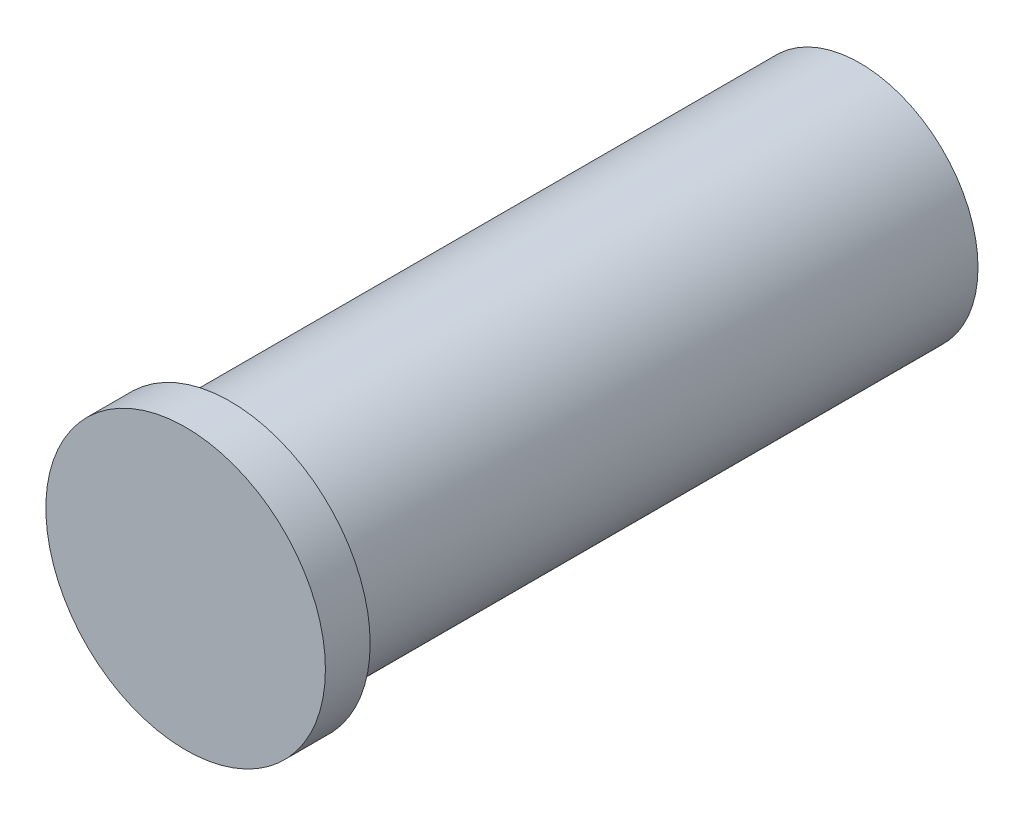
ISO-10303-21;
HEADER;
FILE_DESCRIPTION(('STEP AP214'),'2;1');
FILE_NAME('part.step','',(''),(''),'','','');
FILE_SCHEMA(('AUTOMOTIVE_DESIGN { 1 0 10303 214 1 1 1 1 }'));
ENDSEC;
DATA;
#1=APPLICATION_CONTEXT('core data for automotive mechanical design processes');
#2=APPLICATION_PROTOCOL_DEFINITION('international standard','automotive_design',2000,#1);
#3=PRODUCT_CONTEXT('',#1,'mechanical');
#4=PRODUCT('Part','Part','',(#3));
#5=PRODUCT_RELATED_PRODUCT_CATEGORY('part','',(#4));
#6=PRODUCT_DEFINITION_FORMATION('','',#4);
#7=PRODUCT_DEFINITION_CONTEXT('part definition',#1,'design');
#8=PRODUCT_DEFINITION('design','',#6,#7);
#9=PRODUCT_DEFINITION_SHAPE('','',#8);
#10=(LENGTH_UNIT() NAMED_UNIT(*) SI_UNIT(.MILLI.,.METRE.));
#11=(NAMED_UNIT(*) PLANE_ANGLE_UNIT() SI_UNIT($,.RADIAN.));
#12=(NAMED_UNIT(*) SI_UNIT($,.STERADIAN.) SOLID_ANGLE_UNIT());
#13=UNCERTAINTY_MEASURE_WITH_UNIT(LENGTH_MEASURE(1.E-05),#10,'distance_accuracy_value','');
#14=(GEOMETRIC_REPRESENTATION_CONTEXT(3) GLOBAL_UNCERTAINTY_ASSIGNED_CONTEXT((#13)) GLOBAL_UNIT_ASSIGNED_CONTEXT((#10,
#11,#12)) REPRESENTATION_CONTEXT('',''));
#15=CARTESIAN_POINT('',(0.,0.,0.));
#16=DIRECTION('',(0.,0.,1.));
#17=DIRECTION('',(1.,0.,0.));
#18=AXIS2_PLACEMENT_3D('',#15,#16,#17);
#19=CARTESIAN_POINT('',(0.,0.,0.));
#20=DIRECTION('',(0.,0.,1.));
#21=DIRECTION('',(1.,0.,0.));
#22=AXIS2_PLACEMENT_3D('',#19,#20,#21);
#23=PLANE('',#22);
#24=CARTESIAN_POINT('',(0.,0.,0.));
#25=DIRECTION('',(0.,0.,1.));
#26=DIRECTION('',(1.,0.,0.));
#27=AXIS2_PLACEMENT_3D('',#24,#25,#26);
#28=CIRCLE('',#27,21.11111111375);
#29=CARTESIAN_POINT('',(21.11111111375,0.,0.));
#30=VERTEX_POINT('',#29);
#31=EDGE_CURVE('E38',#30,#30,#28,.T.);
#32=ORIENTED_EDGE('',*,*,#31,.F.);
#33=EDGE_LOOP('',(#32));
#34=FACE_BOUND('',#33,.T.);
#35=CARTESIAN_POINT('',(0.,0.,0.));
#36=DIRECTION('',(0.,0.,1.));
#37=DIRECTION('',(1.,0.,0.));
#38=AXIS2_PLACEMENT_3D('',#35,#36,#37);
#39=CIRCLE('',#38,19.000000002375);
#40=CARTESIAN_POINT('',(19.000000002375,0.,0.));
#41=VERTEX_POINT('',#40);
#42=EDGE_CURVE('E45',#41,#41,#39,.T.);
#43=ORIENTED_EDGE('',*,*,#42,.T.);
#44=EDGE_LOOP('',(#43));
#45=FACE_BOUND('',#44,.T.);
#46=ADVANCED_FACE('F34',(#34,#45),#23,.F.);
#47=CARTESIAN_POINT('',(0.,0.,112.592592606667));
#48=DIRECTION('',(0.,0.,-1.));
#49=DIRECTION('',(-1.,0.,0.));
#50=AXIS2_PLACEMENT_3D('',#47,#48,#49);
#51=CYLINDRICAL_SURFACE('',#50,21.11111111375);
#52=CARTESIAN_POINT('',(0.,0.,112.592592606667));
#53=DIRECTION('',(0.,0.,1.));
#54=DIRECTION('',(1.,0.,0.));
#55=AXIS2_PLACEMENT_3D('',#52,#53,#54);
#56=CIRCLE('',#55,21.11111111375);
#57=CARTESIAN_POINT('',(21.11111111375,0.,112.592592606667));
#58=VERTEX_POINT('',#57);
#59=EDGE_CURVE('E10',#58,#58,#56,.T.);
#60=ORIENTED_EDGE('',*,*,#59,.F.);
#61=EDGE_LOOP('',(#60));
#62=FACE_BOUND('',#61,.T.);
#63=ORIENTED_EDGE('',*,*,#31,.T.);
#64=EDGE_LOOP('',(#63));
#65=FACE_BOUND('',#64,.T.);
#66=ADVANCED_FACE('F36',(#62,#65),#51,.T.);
#67=CARTESIAN_POINT('',(0.,0.,112.592592606667));
#68=DIRECTION('',(0.,0.,-1.));
#69=DIRECTION('',(-1.,0.,0.));
#70=AXIS2_PLACEMENT_3D('',#67,#68,#69);
#71=CYLINDRICAL_SURFACE('',#70,19.000000002375);
#72=CARTESIAN_POINT('',(0.,0.,112.592592606667));
#73=DIRECTION('',(0.,0.,1.));
#74=DIRECTION('',(1.,0.,0.));
#75=AXIS2_PLACEMENT_3D('',#72,#73,#74);
#76=CIRCLE('',#75,19.000000002375);
#77=CARTESIAN_POINT('',(19.000000002375,0.,112.592592606667));
#78=VERTEX_POINT('',#77);
#79=EDGE_CURVE('E49',#78,#78,#76,.T.);
#80=ORIENTED_EDGE('',*,*,#79,.T.);
#81=EDGE_LOOP('',(#80));
#82=FACE_BOUND('',#81,.T.);
#83=ORIENTED_EDGE('',*,*,#42,.F.);
#84=EDGE_LOOP('',(#83));
#85=FACE_BOUND('',#84,.T.);
#86=ADVANCED_FACE('F76',(#82,#85),#71,.F.);
#87=CARTESIAN_POINT('',(0.,0.,112.592592606667));
#88=DIRECTION('',(0.,0.,1.));
#89=DIRECTION('',(1.,0.,0.));
#90=AXIS2_PLACEMENT_3D('',#87,#88,#89);
#91=PLANE('',#90);
#92=ORIENTED_EDGE('',*,*,#79,.F.);
#93=EDGE_LOOP('',(#92));
#94=FACE_BOUND('',#93,.T.);
#95=ADVANCED_FACE('F64',(#94),#91,.F.);
#96=CARTESIAN_POINT('',(0.,0.,120.592592606667));
#97=DIRECTION('',(0.,0.,-1.));
#98=DIRECTION('',(-1.,0.,0.));
#99=AXIS2_PLACEMENT_3D('',#96,#97,#98);
#100=CYLINDRICAL_SURFACE('',#99,25.);
#101=CARTESIAN_POINT('',(0.,0.,120.592592606667));
#102=DIRECTION('',(0.,0.,1.));
#103=DIRECTION('',(1.,0.,0.));
#104=AXIS2_PLACEMENT_3D('',#101,#102,#103);
#105=CIRCLE('',#104,25.);
#106=CARTESIAN_POINT('',(25.,0.,120.592592606667));
#107=VERTEX_POINT('',#106);
#108=EDGE_CURVE('E52',#107,#107,#105,.T.);
#109=ORIENTED_EDGE('',*,*,#108,.F.);
#110=EDGE_LOOP('',(#109));
#111=FACE_BOUND('',#110,.T.);
#112=CARTESIAN_POINT('',(0.,0.,112.592592606667));
#113=DIRECTION('',(0.,0.,1.));
#114=DIRECTION('',(1.,0.,0.));
#115=AXIS2_PLACEMENT_3D('',#112,#113,#114);
#116=CIRCLE('',#115,25.);
#117=CARTESIAN_POINT('',(25.,0.,112.592592606667));
#118=VERTEX_POINT('',#117);
#119=EDGE_CURVE('E53',#118,#118,#116,.T.);
#120=ORIENTED_EDGE('',*,*,#119,.T.);
#121=EDGE_LOOP('',(#120));
#122=FACE_BOUND('',#121,.T.);
#123=ADVANCED_FACE('F61',(#111,#122),#100,.T.);
#124=CARTESIAN_POINT('',(0.,0.,120.592592606667));
#125=DIRECTION('',(0.,0.,1.));
#126=DIRECTION('',(1.,0.,0.));
#127=AXIS2_PLACEMENT_3D('',#124,#125,#126);
#128=PLANE('',#127);
#129=ORIENTED_EDGE('',*,*,#108,.T.);
#130=EDGE_LOOP('',(#129));
#131=FACE_BOUND('',#130,.T.);
#132=ADVANCED_FACE('F59',(#131),#128,.T.);
#133=ORIENTED_EDGE('',*,*,#59,.T.);
#134=EDGE_LOOP('',(#133));
#135=FACE_BOUND('',#134,.T.);
#136=ORIENTED_EDGE('',*,*,#119,.F.);
#137=EDGE_LOOP('',(#136));
#138=FACE_BOUND('',#137,.T.);
#139=ADVANCED_FACE('F68',(#135,#138),#91,.F.);
#140=CLOSED_SHELL('',(#46,#66,#86,#95,#123,#132,#139));
#141=MANIFOLD_SOLID_BREP('B2',#140);
#142=ADVANCED_BREP_SHAPE_REPRESENTATION('',(#18,#141),#14);
#143=SHAPE_DEFINITION_REPRESENTATION(#9,#142);
ENDSEC;
END-ISO-10303-21;
